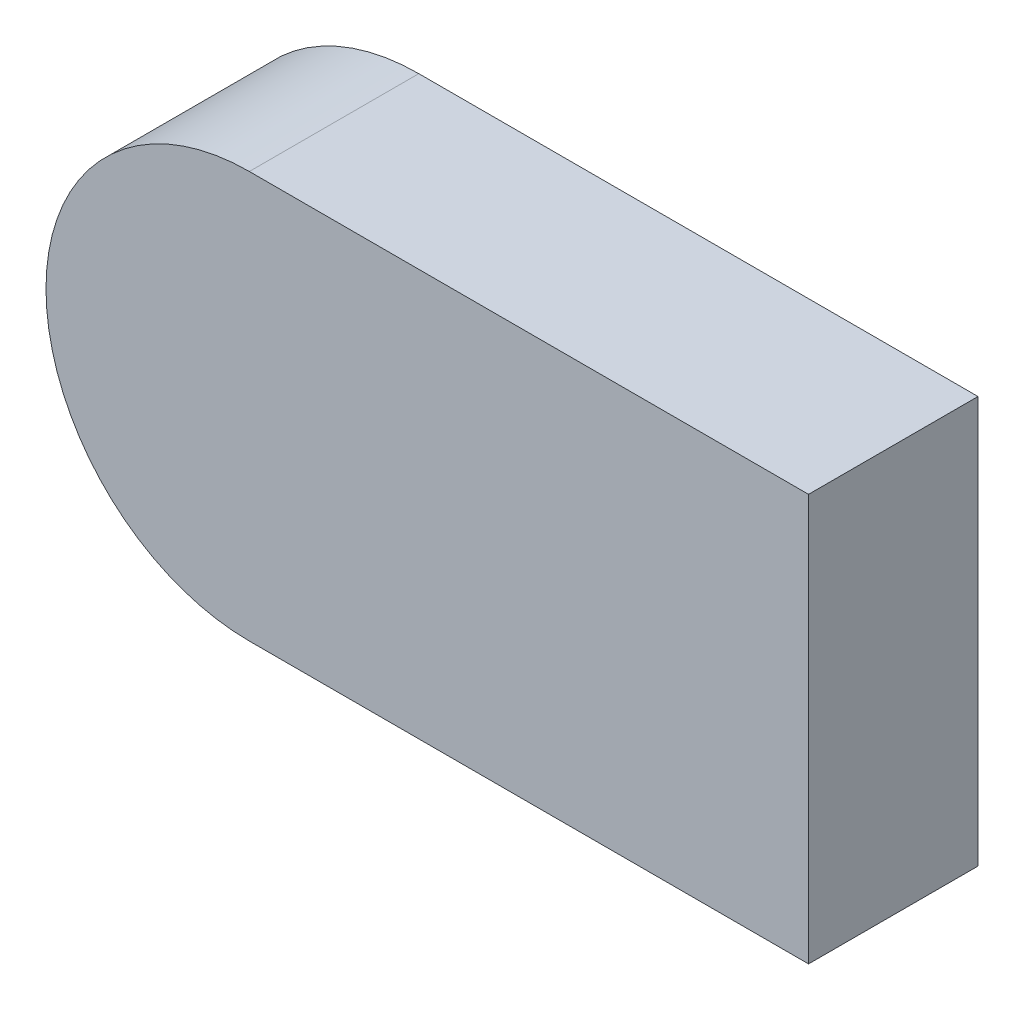
ISO-10303-21;
HEADER;
FILE_DESCRIPTION(('STEP AP214'),'2;1');
FILE_NAME('part.step','',(''),(''),'','','');
FILE_SCHEMA(('AUTOMOTIVE_DESIGN { 1 0 10303 214 1 1 1 1 }'));
ENDSEC;
DATA;
#1=APPLICATION_CONTEXT('core data for automotive mechanical design processes');
#2=APPLICATION_PROTOCOL_DEFINITION('international standard','automotive_design',2000,#1);
#3=PRODUCT_CONTEXT('',#1,'mechanical');
#4=PRODUCT('Part','Part','',(#3));
#5=PRODUCT_RELATED_PRODUCT_CATEGORY('part','',(#4));
#6=PRODUCT_DEFINITION_FORMATION('','',#4);
#7=PRODUCT_DEFINITION_CONTEXT('part definition',#1,'design');
#8=PRODUCT_DEFINITION('design','',#6,#7);
#9=PRODUCT_DEFINITION_SHAPE('','',#8);
#10=(LENGTH_UNIT() NAMED_UNIT(*) SI_UNIT(.MILLI.,.METRE.));
#11=(NAMED_UNIT(*) PLANE_ANGLE_UNIT() SI_UNIT($,.RADIAN.));
#12=(NAMED_UNIT(*) SI_UNIT($,.STERADIAN.) SOLID_ANGLE_UNIT());
#13=UNCERTAINTY_MEASURE_WITH_UNIT(LENGTH_MEASURE(1.E-05),#10,'distance_accuracy_value','');
#14=(GEOMETRIC_REPRESENTATION_CONTEXT(3) GLOBAL_UNCERTAINTY_ASSIGNED_CONTEXT((#13)) GLOBAL_UNIT_ASSIGNED_CONTEXT((#10,
#11,#12)) REPRESENTATION_CONTEXT('',''));
#15=CARTESIAN_POINT('',(0.,0.,0.));
#16=DIRECTION('',(0.,0.,1.));
#17=DIRECTION('',(1.,0.,0.));
#18=AXIS2_PLACEMENT_3D('',#15,#16,#17);
#19=CARTESIAN_POINT('',(4.05,1.13,0.));
#20=DIRECTION('',(0.,-1.,0.));
#21=DIRECTION('',(-1.,0.,0.));
#22=AXIS2_PLACEMENT_3D('',#19,#20,#21);
#23=PLANE('',#22);
#24=DIRECTION('',(0.,0.,1.));
#25=VECTOR('',#24,1.);
#26=CARTESIAN_POINT('',(4.05,1.13,0.));
#27=LINE('',#26,#25);
#28=CARTESIAN_POINT('',(4.05,1.13,0.));
#29=VERTEX_POINT('',#28);
#30=CARTESIAN_POINT('',(4.05,1.13,0.1));
#31=VERTEX_POINT('',#30);
#32=EDGE_CURVE('E11',#29,#31,#27,.T.);
#33=ORIENTED_EDGE('',*,*,#32,.T.);
#34=DIRECTION('',(-1.,0.,0.));
#35=VECTOR('',#34,1.);
#36=CARTESIAN_POINT('',(4.05,1.13,0.1));
#37=LINE('',#36,#35);
#38=CARTESIAN_POINT('',(3.72,1.13,0.1));
#39=VERTEX_POINT('',#38);
#40=EDGE_CURVE('E24',#31,#39,#37,.T.);
#41=ORIENTED_EDGE('',*,*,#40,.T.);
#42=DIRECTION('',(0.,0.,1.));
#43=VECTOR('',#42,1.);
#44=CARTESIAN_POINT('',(3.72,1.13,0.));
#45=LINE('',#44,#43);
#46=CARTESIAN_POINT('',(3.72,1.13,0.));
#47=VERTEX_POINT('',#46);
#48=EDGE_CURVE('E86',#47,#39,#45,.T.);
#49=ORIENTED_EDGE('',*,*,#48,.F.);
#50=DIRECTION('',(-1.,0.,0.));
#51=VECTOR('',#50,1.);
#52=CARTESIAN_POINT('',(4.05,1.13,0.));
#53=LINE('',#52,#51);
#54=EDGE_CURVE('E83',#29,#47,#53,.T.);
#55=ORIENTED_EDGE('',*,*,#54,.F.);
#56=EDGE_LOOP('',(#33,#41,#49,#55));
#57=FACE_BOUND('',#56,.T.);
#58=ADVANCED_FACE('F17',(#57),#23,.T.);
#59=CARTESIAN_POINT('',(3.72,1.25,0.));
#60=DIRECTION('',(0.,0.,-1.));
#61=DIRECTION('',(1.,0.,0.));
#62=AXIS2_PLACEMENT_3D('',#59,#60,#61);
#63=CYLINDRICAL_SURFACE('',#62,0.12);
#64=CARTESIAN_POINT('',(3.72,1.25,0.));
#65=DIRECTION('',(0.,0.,1.));
#66=DIRECTION('',(1.,0.,0.));
#67=AXIS2_PLACEMENT_3D('',#64,#65,#66);
#68=CIRCLE('',#67,0.12);
#69=CARTESIAN_POINT('',(3.72,1.37,0.));
#70=VERTEX_POINT('',#69);
#71=EDGE_CURVE('E80',#70,#47,#68,.T.);
#72=ORIENTED_EDGE('',*,*,#71,.T.);
#73=ORIENTED_EDGE('',*,*,#48,.T.);
#74=CARTESIAN_POINT('',(3.72,1.25,0.1));
#75=DIRECTION('',(0.,0.,1.));
#76=DIRECTION('',(1.,0.,0.));
#77=AXIS2_PLACEMENT_3D('',#74,#75,#76);
#78=CIRCLE('',#77,0.12);
#79=CARTESIAN_POINT('',(3.72,1.37,0.1));
#80=VERTEX_POINT('',#79);
#81=EDGE_CURVE('E78',#80,#39,#78,.T.);
#82=ORIENTED_EDGE('',*,*,#81,.F.);
#83=DIRECTION('',(0.,0.,1.));
#84=VECTOR('',#83,1.);
#85=CARTESIAN_POINT('',(3.72,1.37,0.));
#86=LINE('',#85,#84);
#87=EDGE_CURVE('E67',#70,#80,#86,.T.);
#88=ORIENTED_EDGE('',*,*,#87,.F.);
#89=EDGE_LOOP('',(#72,#73,#82,#88));
#90=FACE_BOUND('',#89,.T.);
#91=ADVANCED_FACE('F89',(#90),#63,.T.);
#92=CARTESIAN_POINT('',(4.05,1.37,0.));
#93=DIRECTION('',(0.,-1.,0.));
#94=DIRECTION('',(-1.,0.,0.));
#95=AXIS2_PLACEMENT_3D('',#92,#93,#94);
#96=PLANE('',#95);
#97=DIRECTION('',(-1.,0.,0.));
#98=VECTOR('',#97,1.);
#99=CARTESIAN_POINT('',(4.05,1.37,0.));
#100=LINE('',#99,#98);
#101=CARTESIAN_POINT('',(4.05,1.37,0.));
#102=VERTEX_POINT('',#101);
#103=EDGE_CURVE('E70',#102,#70,#100,.T.);
#104=ORIENTED_EDGE('',*,*,#103,.T.);
#105=ORIENTED_EDGE('',*,*,#87,.T.);
#106=DIRECTION('',(-1.,0.,0.));
#107=VECTOR('',#106,1.);
#108=CARTESIAN_POINT('',(4.05,1.37,0.1));
#109=LINE('',#108,#107);
#110=CARTESIAN_POINT('',(4.05,1.37,0.1));
#111=VERTEX_POINT('',#110);
#112=EDGE_CURVE('E61',#111,#80,#109,.T.);
#113=ORIENTED_EDGE('',*,*,#112,.F.);
#114=DIRECTION('',(0.,0.,1.));
#115=VECTOR('',#114,1.);
#116=CARTESIAN_POINT('',(4.05,1.37,0.));
#117=LINE('',#116,#115);
#118=EDGE_CURVE('E51',#102,#111,#117,.T.);
#119=ORIENTED_EDGE('',*,*,#118,.F.);
#120=EDGE_LOOP('',(#104,#105,#113,#119));
#121=FACE_BOUND('',#120,.T.);
#122=ADVANCED_FACE('F65',(#121),#96,.F.);
#123=CARTESIAN_POINT('',(4.05,1.13,0.));
#124=DIRECTION('',(-1.,0.,0.));
#125=DIRECTION('',(0.,1.,0.));
#126=AXIS2_PLACEMENT_3D('',#123,#124,#125);
#127=PLANE('',#126);
#128=DIRECTION('',(0.,1.,0.));
#129=VECTOR('',#128,1.);
#130=CARTESIAN_POINT('',(4.05,1.13,0.));
#131=LINE('',#130,#129);
#132=EDGE_CURVE('E57',#29,#102,#131,.T.);
#133=ORIENTED_EDGE('',*,*,#132,.T.);
#134=ORIENTED_EDGE('',*,*,#118,.T.);
#135=DIRECTION('',(0.,1.,0.));
#136=VECTOR('',#135,1.);
#137=CARTESIAN_POINT('',(4.05,1.13,0.1));
#138=LINE('',#137,#136);
#139=EDGE_CURVE('E55',#31,#111,#138,.T.);
#140=ORIENTED_EDGE('',*,*,#139,.F.);
#141=ORIENTED_EDGE('',*,*,#32,.F.);
#142=EDGE_LOOP('',(#133,#134,#140,#141));
#143=FACE_BOUND('',#142,.T.);
#144=ADVANCED_FACE('F53',(#143),#127,.F.);
#145=CARTESIAN_POINT('',(3.849490847913,1.25,0.));
#146=DIRECTION('',(0.,0.,-1.));
#147=DIRECTION('',(-1.,0.,0.));
#148=AXIS2_PLACEMENT_3D('',#145,#146,#147);
#149=PLANE('',#148);
#150=ORIENTED_EDGE('',*,*,#54,.T.);
#151=ORIENTED_EDGE('',*,*,#71,.F.);
#152=ORIENTED_EDGE('',*,*,#103,.F.);
#153=ORIENTED_EDGE('',*,*,#132,.F.);
#154=EDGE_LOOP('',(#150,#151,#152,#153));
#155=FACE_BOUND('',#154,.T.);
#156=ADVANCED_FACE('F91',(#155),#149,.T.);
#157=CARTESIAN_POINT('',(3.849490847913,1.25,0.1));
#158=DIRECTION('',(0.,0.,-1.));
#159=DIRECTION('',(-1.,0.,0.));
#160=AXIS2_PLACEMENT_3D('',#157,#158,#159);
#161=PLANE('',#160);
#162=ORIENTED_EDGE('',*,*,#139,.T.);
#163=ORIENTED_EDGE('',*,*,#112,.T.);
#164=ORIENTED_EDGE('',*,*,#81,.T.);
#165=ORIENTED_EDGE('',*,*,#40,.F.);
#166=EDGE_LOOP('',(#162,#163,#164,#165));
#167=FACE_BOUND('',#166,.T.);
#168=ADVANCED_FACE('F72',(#167),#161,.F.);
#169=CLOSED_SHELL('',(#58,#91,#122,#144,#156,#168));
#170=MANIFOLD_SOLID_BREP('B1',#169);
#171=ADVANCED_BREP_SHAPE_REPRESENTATION('',(#18,#170),#14);
#172=SHAPE_DEFINITION_REPRESENTATION(#9,#171);
ENDSEC;
END-ISO-10303-21;
